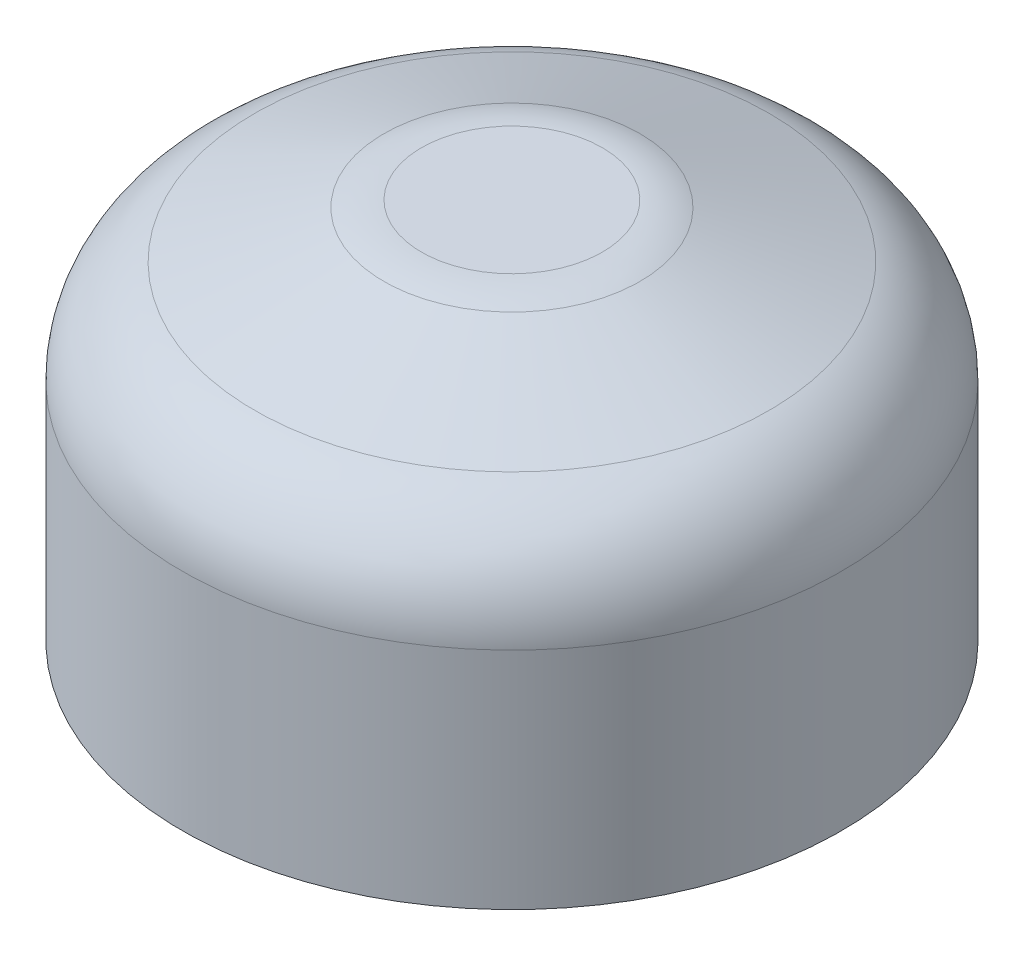
ISO-10303-21;
HEADER;
FILE_DESCRIPTION(('STEP AP214'),'2;1');
FILE_NAME('part.step','',(''),(''),'','','');
FILE_SCHEMA(('AUTOMOTIVE_DESIGN { 1 0 10303 214 1 1 1 1 }'));
ENDSEC;
DATA;
#1=APPLICATION_CONTEXT('core data for automotive mechanical design processes');
#2=APPLICATION_PROTOCOL_DEFINITION('international standard','automotive_design',2000,#1);
#3=PRODUCT_CONTEXT('',#1,'mechanical');
#4=PRODUCT('Part','Part','',(#3));
#5=PRODUCT_RELATED_PRODUCT_CATEGORY('part','',(#4));
#6=PRODUCT_DEFINITION_FORMATION('','',#4);
#7=PRODUCT_DEFINITION_CONTEXT('part definition',#1,'design');
#8=PRODUCT_DEFINITION('design','',#6,#7);
#9=PRODUCT_DEFINITION_SHAPE('','',#8);
#10=(LENGTH_UNIT() NAMED_UNIT(*) SI_UNIT(.MILLI.,.METRE.));
#11=(NAMED_UNIT(*) PLANE_ANGLE_UNIT() SI_UNIT($,.RADIAN.));
#12=(NAMED_UNIT(*) SI_UNIT($,.STERADIAN.) SOLID_ANGLE_UNIT());
#13=UNCERTAINTY_MEASURE_WITH_UNIT(LENGTH_MEASURE(1.E-05),#10,'distance_accuracy_value','');
#14=(GEOMETRIC_REPRESENTATION_CONTEXT(3) GLOBAL_UNCERTAINTY_ASSIGNED_CONTEXT((#13)) GLOBAL_UNIT_ASSIGNED_CONTEXT((#10,
#11,#12)) REPRESENTATION_CONTEXT('',''));
#15=CARTESIAN_POINT('',(0.,0.,0.));
#16=DIRECTION('',(0.,0.,1.));
#17=DIRECTION('',(1.,0.,0.));
#18=AXIS2_PLACEMENT_3D('',#15,#16,#17);
#19=CARTESIAN_POINT('',(-9.525,0.,0.));
#20=DIRECTION('',(0.,1.,0.));
#21=DIRECTION('',(0.,0.,1.));
#22=AXIS2_PLACEMENT_3D('',#19,#20,#21);
#23=PLANE('',#22);
#24=CARTESIAN_POINT('',(-4.94933518262809,0.,-2.85749999999995));
#25=DIRECTION('',(0.,-1.,0.));
#26=DIRECTION('',(0.866025403784443,0.,0.499999999999992));
#27=AXIS2_PLACEMENT_3D('',#24,#25,#26);
#28=CIRCLE('',#27,1.13029999999999);
#29=CARTESIAN_POINT('',(-3.97046666873055,0.,-2.29234999999997));
#30=VERTEX_POINT('',#29);
#31=EDGE_CURVE('E66',#30,#30,#28,.T.);
#32=ORIENTED_EDGE('',*,*,#31,.F.);
#33=EDGE_LOOP('',(#32));
#34=FACE_BOUND('',#33,.T.);
#35=CARTESIAN_POINT('',(4.94933518262805,0.,-2.85750000000002));
#36=DIRECTION('',(0.,-1.,0.));
#37=DIRECTION('',(-0.866025403784436,0.,0.500000000000004));
#38=AXIS2_PLACEMENT_3D('',#35,#36,#37);
#39=CIRCLE('',#38,1.13029999999999);
#40=CARTESIAN_POINT('',(3.97046666873052,0.,-2.29235000000002));
#41=VERTEX_POINT('',#40);
#42=EDGE_CURVE('E65',#41,#41,#39,.T.);
#43=ORIENTED_EDGE('',*,*,#42,.F.);
#44=EDGE_LOOP('',(#43));
#45=FACE_BOUND('',#44,.T.);
#46=CARTESIAN_POINT('',(0.,0.,5.715));
#47=DIRECTION('',(0.,-1.,0.));
#48=DIRECTION('',(0.,0.,-1.));
#49=AXIS2_PLACEMENT_3D('',#46,#47,#48);
#50=CIRCLE('',#49,1.13029999999999);
#51=CARTESIAN_POINT('',(0.,0.,4.58470000000001));
#52=VERTEX_POINT('',#51);
#53=EDGE_CURVE('E76',#52,#52,#50,.T.);
#54=ORIENTED_EDGE('',*,*,#53,.F.);
#55=EDGE_LOOP('',(#54));
#56=FACE_BOUND('',#55,.T.);
#57=CARTESIAN_POINT('',(0.,0.,0.));
#58=DIRECTION('',(0.,-1.,0.));
#59=DIRECTION('',(0.,0.,-1.));
#60=AXIS2_PLACEMENT_3D('',#57,#58,#59);
#61=CIRCLE('',#60,9.525);
#62=CARTESIAN_POINT('',(0.,0.,-9.525));
#63=VERTEX_POINT('',#62);
#64=EDGE_CURVE('E82',#63,#63,#61,.T.);
#65=ORIENTED_EDGE('',*,*,#64,.T.);
#66=EDGE_LOOP('',(#65));
#67=FACE_BOUND('',#66,.T.);
#68=ADVANCED_FACE('F38',(#34,#45,#56,#67),#23,.F.);
#69=CARTESIAN_POINT('',(0.,11.02868,0.));
#70=DIRECTION('',(0.,-1.,0.));
#71=DIRECTION('',(0.,0.,-1.));
#72=AXIS2_PLACEMENT_3D('',#69,#70,#71);
#73=PLANE('',#72);
#74=CARTESIAN_POINT('',(0.,11.02868,0.));
#75=DIRECTION('',(0.,-1.,0.));
#76=DIRECTION('',(0.,0.,-1.));
#77=AXIS2_PLACEMENT_3D('',#74,#75,#76);
#78=CIRCLE('',#77,2.61516183625062);
#79=CARTESIAN_POINT('',(0.,11.02868,-2.61516183625062));
#80=VERTEX_POINT('',#79);
#81=EDGE_CURVE('E11',#80,#80,#78,.T.);
#82=ORIENTED_EDGE('',*,*,#81,.F.);
#83=EDGE_LOOP('',(#82));
#84=FACE_BOUND('',#83,.T.);
#85=ADVANCED_FACE('F98',(#84),#73,.F.);
#86=CARTESIAN_POINT('',(0.,7.85368,0.));
#87=DIRECTION('',(0.,-1.,0.));
#88=DIRECTION('',(0.,0.,-1.));
#89=AXIS2_PLACEMENT_3D('',#86,#87,#88);
#90=DEGENERATE_TOROIDAL_SURFACE('',#89,2.61516183625063,3.175,.T.);
#91=CARTESIAN_POINT('',(0.,10.8372040709953,0.));
#92=DIRECTION('',(0.,-1.,0.));
#93=DIRECTION('',(0.,0.,-1.));
#94=AXIS2_PLACEMENT_3D('',#91,#92,#93);
#95=CIRCLE('',#94,3.70107579130962);
#96=CARTESIAN_POINT('',(0.,10.8372040709953,-3.70107579130962));
#97=VERTEX_POINT('',#96);
#98=EDGE_CURVE('E45',#97,#97,#95,.T.);
#99=ORIENTED_EDGE('',*,*,#98,.F.);
#100=EDGE_LOOP('',(#99));
#101=FACE_BOUND('',#100,.T.);
#102=ORIENTED_EDGE('',*,*,#81,.T.);
#103=EDGE_LOOP('',(#102));
#104=FACE_BOUND('',#103,.T.);
#105=ADVANCED_FACE('F95',(#101,#104),#90,.T.);
#106=CARTESIAN_POINT('',(0.,10.8372040709953,0.));
#107=DIRECTION('',(0.,-1.,0.));
#108=DIRECTION('',(0.,0.,-1.));
#109=AXIS2_PLACEMENT_3D('',#106,#107,#108);
#110=CONICAL_SURFACE('',#109,3.70107579130962,1.22173047639604);
#111=CARTESIAN_POINT('',(0.,9.47783414958909,0.));
#112=DIRECTION('',(0.,-1.,0.));
#113=DIRECTION('',(0.,0.,-1.));
#114=AXIS2_PLACEMENT_3D('',#111,#112,#113);
#115=CIRCLE('',#114,7.43591395505896);
#116=CARTESIAN_POINT('',(0.,9.47783414958909,-7.43591395505896));
#117=VERTEX_POINT('',#116);
#118=EDGE_CURVE('E88',#117,#117,#115,.T.);
#119=ORIENTED_EDGE('',*,*,#118,.F.);
#120=EDGE_LOOP('',(#119));
#121=FACE_BOUND('',#120,.T.);
#122=ORIENTED_EDGE('',*,*,#98,.T.);
#123=EDGE_LOOP('',(#122));
#124=FACE_BOUND('',#123,.T.);
#125=ADVANCED_FACE('F93',(#121,#124),#110,.T.);
#126=CARTESIAN_POINT('',(0.,6.49431007859381,0.));
#127=DIRECTION('',(0.,-1.,0.));
#128=DIRECTION('',(0.,0.,-1.));
#129=AXIS2_PLACEMENT_3D('',#126,#127,#128);
#130=TOROIDAL_SURFACE('',#129,6.35,3.175);
#131=CARTESIAN_POINT('',(0.,6.4943100785938,0.));
#132=DIRECTION('',(0.,-1.,0.));
#133=DIRECTION('',(0.,0.,-1.));
#134=AXIS2_PLACEMENT_3D('',#131,#132,#133);
#135=CIRCLE('',#134,9.525);
#136=CARTESIAN_POINT('',(0.,6.4943100785938,-9.525));
#137=VERTEX_POINT('',#136);
#138=EDGE_CURVE('E85',#137,#137,#135,.T.);
#139=ORIENTED_EDGE('',*,*,#138,.F.);
#140=EDGE_LOOP('',(#139));
#141=FACE_BOUND('',#140,.T.);
#142=ORIENTED_EDGE('',*,*,#118,.T.);
#143=EDGE_LOOP('',(#142));
#144=FACE_BOUND('',#143,.T.);
#145=ADVANCED_FACE('F110',(#141,#144),#130,.T.);
#146=CARTESIAN_POINT('',(0.,-0.551434000000002,0.));
#147=DIRECTION('',(0.,-1.,0.));
#148=DIRECTION('',(0.,0.,-1.));
#149=AXIS2_PLACEMENT_3D('',#146,#147,#148);
#150=CYLINDRICAL_SURFACE('',#149,9.525);
#151=ORIENTED_EDGE('',*,*,#64,.F.);
#152=EDGE_LOOP('',(#151));
#153=FACE_BOUND('',#152,.T.);
#154=ORIENTED_EDGE('',*,*,#138,.T.);
#155=EDGE_LOOP('',(#154));
#156=FACE_BOUND('',#155,.T.);
#157=ADVANCED_FACE('F114',(#153,#156),#150,.T.);
#158=CARTESIAN_POINT('',(0.,8.509,5.715));
#159=DIRECTION('',(0.,-1.,0.));
#160=DIRECTION('',(0.,0.,-1.));
#161=AXIS2_PLACEMENT_3D('',#158,#159,#160);
#162=CONICAL_SURFACE('',#161,1.1303,1.02974425867665);
#163=CARTESIAN_POINT('',(0.,9.18815275768685,5.715));
#164=VERTEX_POINT('',#163);
#165=VERTEX_LOOP('',#164);
#166=FACE_BOUND('',#165,.T.);
#167=CARTESIAN_POINT('',(0.,8.509,5.715));
#168=DIRECTION('',(0.,-1.,0.));
#169=DIRECTION('',(0.,0.,-1.));
#170=AXIS2_PLACEMENT_3D('',#167,#168,#169);
#171=CIRCLE('',#170,1.1303);
#172=CARTESIAN_POINT('',(0.,8.509,4.5847));
#173=VERTEX_POINT('',#172);
#174=EDGE_CURVE('E79',#173,#173,#171,.T.);
#175=ORIENTED_EDGE('',*,*,#174,.T.);
#176=EDGE_LOOP('',(#175));
#177=FACE_BOUND('',#176,.T.);
#178=ADVANCED_FACE('F118',(#166,#177),#162,.F.);
#179=CARTESIAN_POINT('',(0.,0.,5.715));
#180=DIRECTION('',(0.,-1.,0.));
#181=DIRECTION('',(0.,0.,-1.));
#182=AXIS2_PLACEMENT_3D('',#179,#180,#181);
#183=CYLINDRICAL_SURFACE('',#182,1.13029999999999);
#184=ORIENTED_EDGE('',*,*,#174,.F.);
#185=EDGE_LOOP('',(#184));
#186=FACE_BOUND('',#185,.T.);
#187=ORIENTED_EDGE('',*,*,#53,.T.);
#188=EDGE_LOOP('',(#187));
#189=FACE_BOUND('',#188,.T.);
#190=ADVANCED_FACE('F122',(#186,#189),#183,.F.);
#191=CARTESIAN_POINT('',(4.94933518262805,8.509,-2.85750000000002));
#192=DIRECTION('',(0.,-1.,0.));
#193=DIRECTION('',(-0.866025403784436,0.,0.500000000000004));
#194=AXIS2_PLACEMENT_3D('',#191,#192,#193);
#195=CONICAL_SURFACE('',#194,1.1303,1.02974425867665);
#196=CARTESIAN_POINT('',(4.94933518262806,9.18815275768685,-2.85750000000002));
#197=VERTEX_POINT('',#196);
#198=VERTEX_LOOP('',#197);
#199=FACE_BOUND('',#198,.T.);
#200=CARTESIAN_POINT('',(4.94933518262805,8.509,-2.85750000000002));
#201=DIRECTION('',(0.,-1.,0.));
#202=DIRECTION('',(-0.866025403784436,0.,0.500000000000004));
#203=AXIS2_PLACEMENT_3D('',#200,#201,#202);
#204=CIRCLE('',#203,1.1303);
#205=CARTESIAN_POINT('',(3.97046666873051,8.509,-2.29235000000002));
#206=VERTEX_POINT('',#205);
#207=EDGE_CURVE('E69',#206,#206,#204,.T.);
#208=ORIENTED_EDGE('',*,*,#207,.T.);
#209=EDGE_LOOP('',(#208));
#210=FACE_BOUND('',#209,.T.);
#211=ADVANCED_FACE('F125',(#199,#210),#195,.F.);
#212=CARTESIAN_POINT('',(4.94933518262805,0.,-2.85750000000002));
#213=DIRECTION('',(0.,-1.,0.));
#214=DIRECTION('',(-0.866025403784436,0.,0.500000000000004));
#215=AXIS2_PLACEMENT_3D('',#212,#213,#214);
#216=CYLINDRICAL_SURFACE('',#215,1.13029999999999);
#217=ORIENTED_EDGE('',*,*,#207,.F.);
#218=EDGE_LOOP('',(#217));
#219=FACE_BOUND('',#218,.T.);
#220=ORIENTED_EDGE('',*,*,#42,.T.);
#221=EDGE_LOOP('',(#220));
#222=FACE_BOUND('',#221,.T.);
#223=ADVANCED_FACE('F59',(#219,#222),#216,.F.);
#224=CARTESIAN_POINT('',(-4.94933518262809,8.509,-2.85749999999995));
#225=DIRECTION('',(0.,-1.,0.));
#226=DIRECTION('',(0.866025403784443,0.,0.499999999999992));
#227=AXIS2_PLACEMENT_3D('',#224,#225,#226);
#228=CONICAL_SURFACE('',#227,1.1303,1.02974425867665);
#229=CARTESIAN_POINT('',(-4.94933518262809,9.18815275768685,-2.85749999999996));
#230=VERTEX_POINT('',#229);
#231=VERTEX_LOOP('',#230);
#232=FACE_BOUND('',#231,.T.);
#233=CARTESIAN_POINT('',(-4.94933518262809,8.509,-2.85749999999995));
#234=DIRECTION('',(0.,-1.,0.));
#235=DIRECTION('',(0.866025403784443,0.,0.499999999999992));
#236=AXIS2_PLACEMENT_3D('',#233,#234,#235);
#237=CIRCLE('',#236,1.1303);
#238=CARTESIAN_POINT('',(-3.97046666873054,8.509,-2.29234999999996));
#239=VERTEX_POINT('',#238);
#240=EDGE_CURVE('E63',#239,#239,#237,.T.);
#241=ORIENTED_EDGE('',*,*,#240,.T.);
#242=EDGE_LOOP('',(#241));
#243=FACE_BOUND('',#242,.T.);
#244=ADVANCED_FACE('F55',(#232,#243),#228,.F.);
#245=CARTESIAN_POINT('',(-4.94933518262809,0.,-2.85749999999995));
#246=DIRECTION('',(0.,-1.,0.));
#247=DIRECTION('',(0.866025403784443,0.,0.499999999999992));
#248=AXIS2_PLACEMENT_3D('',#245,#246,#247);
#249=CYLINDRICAL_SURFACE('',#248,1.13029999999999);
#250=ORIENTED_EDGE('',*,*,#240,.F.);
#251=EDGE_LOOP('',(#250));
#252=FACE_BOUND('',#251,.T.);
#253=ORIENTED_EDGE('',*,*,#31,.T.);
#254=EDGE_LOOP('',(#253));
#255=FACE_BOUND('',#254,.T.);
#256=ADVANCED_FACE('F58',(#252,#255),#249,.F.);
#257=CLOSED_SHELL('',(#68,#85,#105,#125,#145,#157,#178,#190,#211,#223,#244,#256));
#258=MANIFOLD_SOLID_BREP('B2',#257);
#259=ADVANCED_BREP_SHAPE_REPRESENTATION('',(#18,#258),#14);
#260=SHAPE_DEFINITION_REPRESENTATION(#9,#259);
ENDSEC;
END-ISO-10303-21;
